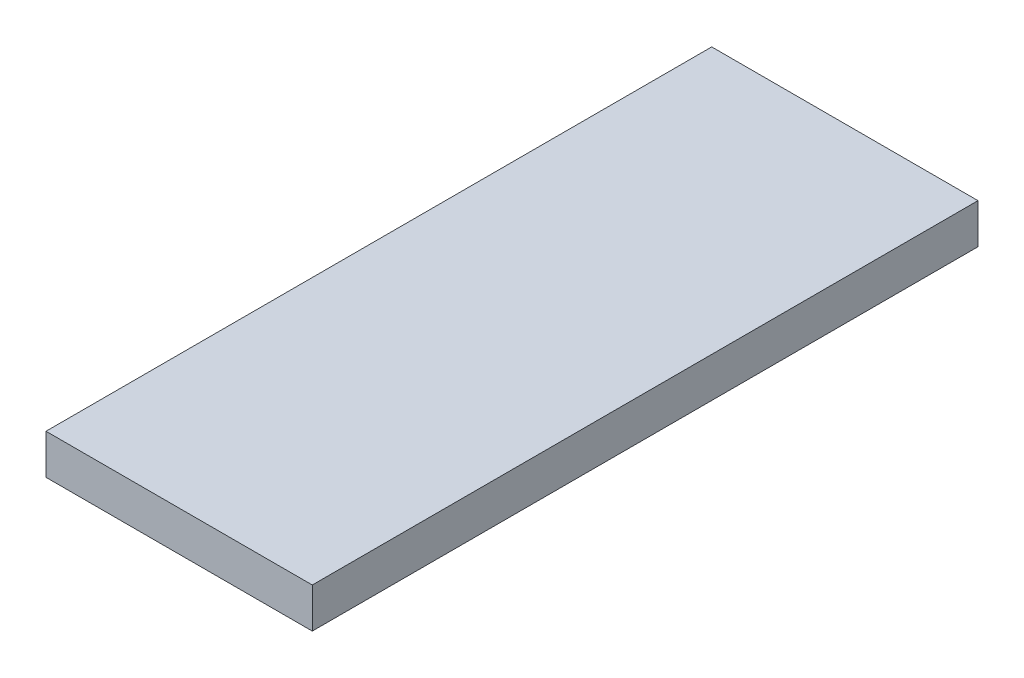
ISO-10303-21;
HEADER;
FILE_DESCRIPTION(('STEP AP214'),'2;1');
FILE_NAME('part.step','',(''),(''),'','','');
FILE_SCHEMA(('AUTOMOTIVE_DESIGN { 1 0 10303 214 1 1 1 1 }'));
ENDSEC;
DATA;
#1=APPLICATION_CONTEXT('core data for automotive mechanical design processes');
#2=APPLICATION_PROTOCOL_DEFINITION('international standard','automotive_design',2000,#1);
#3=PRODUCT_CONTEXT('',#1,'mechanical');
#4=PRODUCT('Part','Part','',(#3));
#5=PRODUCT_RELATED_PRODUCT_CATEGORY('part','',(#4));
#6=PRODUCT_DEFINITION_FORMATION('','',#4);
#7=PRODUCT_DEFINITION_CONTEXT('part definition',#1,'design');
#8=PRODUCT_DEFINITION('design','',#6,#7);
#9=PRODUCT_DEFINITION_SHAPE('','',#8);
#10=(LENGTH_UNIT() NAMED_UNIT(*) SI_UNIT(.MILLI.,.METRE.));
#11=(NAMED_UNIT(*) PLANE_ANGLE_UNIT() SI_UNIT($,.RADIAN.));
#12=(NAMED_UNIT(*) SI_UNIT($,.STERADIAN.) SOLID_ANGLE_UNIT());
#13=UNCERTAINTY_MEASURE_WITH_UNIT(LENGTH_MEASURE(1.E-05),#10,'distance_accuracy_value','');
#14=(GEOMETRIC_REPRESENTATION_CONTEXT(3) GLOBAL_UNCERTAINTY_ASSIGNED_CONTEXT((#13)) GLOBAL_UNIT_ASSIGNED_CONTEXT((#10,
#11,#12)) REPRESENTATION_CONTEXT('',''));
#15=CARTESIAN_POINT('',(0.,0.,0.));
#16=DIRECTION('',(0.,0.,1.));
#17=DIRECTION('',(1.,0.,0.));
#18=AXIS2_PLACEMENT_3D('',#15,#16,#17);
#19=CARTESIAN_POINT('',(0.,7.62,0.));
#20=DIRECTION('',(1.,0.,0.));
#21=DIRECTION('',(0.,0.,-1.));
#22=AXIS2_PLACEMENT_3D('',#19,#20,#21);
#23=PLANE('',#22);
#24=DIRECTION('',(0.,0.,1.));
#25=VECTOR('',#24,1.);
#26=CARTESIAN_POINT('',(0.,0.,0.));
#27=LINE('',#26,#25);
#28=CARTESIAN_POINT('',(0.,0.,-127.));
#29=VERTEX_POINT('',#28);
#30=CARTESIAN_POINT('',(0.,0.,0.));
#31=VERTEX_POINT('',#30);
#32=EDGE_CURVE('E96',#29,#31,#27,.T.);
#33=ORIENTED_EDGE('',*,*,#32,.T.);
#34=DIRECTION('',(0.,-1.,0.));
#35=VECTOR('',#34,1.);
#36=CARTESIAN_POINT('',(0.,7.62,0.));
#37=LINE('',#36,#35);
#38=CARTESIAN_POINT('',(0.,7.62,0.));
#39=VERTEX_POINT('',#38);
#40=EDGE_CURVE('E11',#39,#31,#37,.T.);
#41=ORIENTED_EDGE('',*,*,#40,.F.);
#42=DIRECTION('',(0.,0.,1.));
#43=VECTOR('',#42,1.);
#44=CARTESIAN_POINT('',(0.,7.62,0.));
#45=LINE('',#44,#43);
#46=CARTESIAN_POINT('',(0.,7.62,-127.));
#47=VERTEX_POINT('',#46);
#48=EDGE_CURVE('E84',#47,#39,#45,.T.);
#49=ORIENTED_EDGE('',*,*,#48,.F.);
#50=DIRECTION('',(0.,-1.,0.));
#51=VECTOR('',#50,1.);
#52=CARTESIAN_POINT('',(0.,7.62,-127.));
#53=LINE('',#52,#51);
#54=EDGE_CURVE('E92',#47,#29,#53,.T.);
#55=ORIENTED_EDGE('',*,*,#54,.T.);
#56=EDGE_LOOP('',(#33,#41,#49,#55));
#57=FACE_BOUND('',#56,.T.);
#58=ADVANCED_FACE('F33',(#57),#23,.F.);
#59=CARTESIAN_POINT('',(0.,7.62,0.));
#60=DIRECTION('',(0.,0.,-1.));
#61=DIRECTION('',(-1.,0.,0.));
#62=AXIS2_PLACEMENT_3D('',#59,#60,#61);
#63=PLANE('',#62);
#64=DIRECTION('',(1.,0.,0.));
#65=VECTOR('',#64,1.);
#66=CARTESIAN_POINT('',(0.,0.,0.));
#67=LINE('',#66,#65);
#68=CARTESIAN_POINT('',(50.8,0.,0.));
#69=VERTEX_POINT('',#68);
#70=EDGE_CURVE('E88',#31,#69,#67,.T.);
#71=ORIENTED_EDGE('',*,*,#70,.T.);
#72=DIRECTION('',(0.,-1.,0.));
#73=VECTOR('',#72,1.);
#74=CARTESIAN_POINT('',(50.8,7.62,0.));
#75=LINE('',#74,#73);
#76=CARTESIAN_POINT('',(50.8,7.62,0.));
#77=VERTEX_POINT('',#76);
#78=EDGE_CURVE('E41',#77,#69,#75,.T.);
#79=ORIENTED_EDGE('',*,*,#78,.F.);
#80=DIRECTION('',(1.,0.,0.));
#81=VECTOR('',#80,1.);
#82=CARTESIAN_POINT('',(0.,7.62,0.));
#83=LINE('',#82,#81);
#84=EDGE_CURVE('E79',#39,#77,#83,.T.);
#85=ORIENTED_EDGE('',*,*,#84,.F.);
#86=ORIENTED_EDGE('',*,*,#40,.T.);
#87=EDGE_LOOP('',(#71,#79,#85,#86));
#88=FACE_BOUND('',#87,.T.);
#89=ADVANCED_FACE('F87',(#88),#63,.F.);
#90=CARTESIAN_POINT('',(50.8,7.62,0.));
#91=DIRECTION('',(-1.,0.,0.));
#92=DIRECTION('',(0.,0.,1.));
#93=AXIS2_PLACEMENT_3D('',#90,#91,#92);
#94=PLANE('',#93);
#95=DIRECTION('',(0.,0.,-1.));
#96=VECTOR('',#95,1.);
#97=CARTESIAN_POINT('',(50.8,0.,0.));
#98=LINE('',#97,#96);
#99=CARTESIAN_POINT('',(50.8,0.,-127.));
#100=VERTEX_POINT('',#99);
#101=EDGE_CURVE('E66',#69,#100,#98,.T.);
#102=ORIENTED_EDGE('',*,*,#101,.T.);
#103=DIRECTION('',(0.,-1.,0.));
#104=VECTOR('',#103,1.);
#105=CARTESIAN_POINT('',(50.8,7.62,-127.));
#106=LINE('',#105,#104);
#107=CARTESIAN_POINT('',(50.8,7.62,-127.));
#108=VERTEX_POINT('',#107);
#109=EDGE_CURVE('E89',#108,#100,#106,.T.);
#110=ORIENTED_EDGE('',*,*,#109,.F.);
#111=DIRECTION('',(0.,0.,-1.));
#112=VECTOR('',#111,1.);
#113=CARTESIAN_POINT('',(50.8,7.62,0.));
#114=LINE('',#113,#112);
#115=EDGE_CURVE('E82',#77,#108,#114,.T.);
#116=ORIENTED_EDGE('',*,*,#115,.F.);
#117=ORIENTED_EDGE('',*,*,#78,.T.);
#118=EDGE_LOOP('',(#102,#110,#116,#117));
#119=FACE_BOUND('',#118,.T.);
#120=ADVANCED_FACE('F90',(#119),#94,.F.);
#121=CARTESIAN_POINT('',(0.,7.62,-127.));
#122=DIRECTION('',(0.,0.,1.));
#123=DIRECTION('',(1.,0.,0.));
#124=AXIS2_PLACEMENT_3D('',#121,#122,#123);
#125=PLANE('',#124);
#126=DIRECTION('',(-1.,0.,0.));
#127=VECTOR('',#126,1.);
#128=CARTESIAN_POINT('',(0.,0.,-127.));
#129=LINE('',#128,#127);
#130=EDGE_CURVE('E72',#100,#29,#129,.T.);
#131=ORIENTED_EDGE('',*,*,#130,.T.);
#132=ORIENTED_EDGE('',*,*,#54,.F.);
#133=DIRECTION('',(-1.,0.,0.));
#134=VECTOR('',#133,1.);
#135=CARTESIAN_POINT('',(0.,7.62,-127.));
#136=LINE('',#135,#134);
#137=EDGE_CURVE('E49',#108,#47,#136,.T.);
#138=ORIENTED_EDGE('',*,*,#137,.F.);
#139=ORIENTED_EDGE('',*,*,#109,.T.);
#140=EDGE_LOOP('',(#131,#132,#138,#139));
#141=FACE_BOUND('',#140,.T.);
#142=ADVANCED_FACE('F103',(#141),#125,.F.);
#143=CARTESIAN_POINT('',(0.,7.62,0.));
#144=DIRECTION('',(0.,-1.,0.));
#145=DIRECTION('',(0.,0.,-1.));
#146=AXIS2_PLACEMENT_3D('',#143,#144,#145);
#147=PLANE('',#146);
#148=ORIENTED_EDGE('',*,*,#48,.T.);
#149=ORIENTED_EDGE('',*,*,#84,.T.);
#150=ORIENTED_EDGE('',*,*,#115,.T.);
#151=ORIENTED_EDGE('',*,*,#137,.T.);
#152=EDGE_LOOP('',(#148,#149,#150,#151));
#153=FACE_BOUND('',#152,.T.);
#154=ADVANCED_FACE('F80',(#153),#147,.F.);
#155=CARTESIAN_POINT('',(0.,0.,0.));
#156=DIRECTION('',(0.,-1.,0.));
#157=DIRECTION('',(0.,0.,-1.));
#158=AXIS2_PLACEMENT_3D('',#155,#156,#157);
#159=PLANE('',#158);
#160=ORIENTED_EDGE('',*,*,#32,.F.);
#161=ORIENTED_EDGE('',*,*,#130,.F.);
#162=ORIENTED_EDGE('',*,*,#101,.F.);
#163=ORIENTED_EDGE('',*,*,#70,.F.);
#164=EDGE_LOOP('',(#160,#161,#162,#163));
#165=FACE_BOUND('',#164,.T.);
#166=ADVANCED_FACE('F106',(#165),#159,.T.);
#167=CLOSED_SHELL('',(#58,#89,#120,#142,#154,#166));
#168=MANIFOLD_SOLID_BREP('B2',#167);
#169=ADVANCED_BREP_SHAPE_REPRESENTATION('',(#18,#168),#14);
#170=SHAPE_DEFINITION_REPRESENTATION(#9,#169);
ENDSEC;
END-ISO-10303-21;
